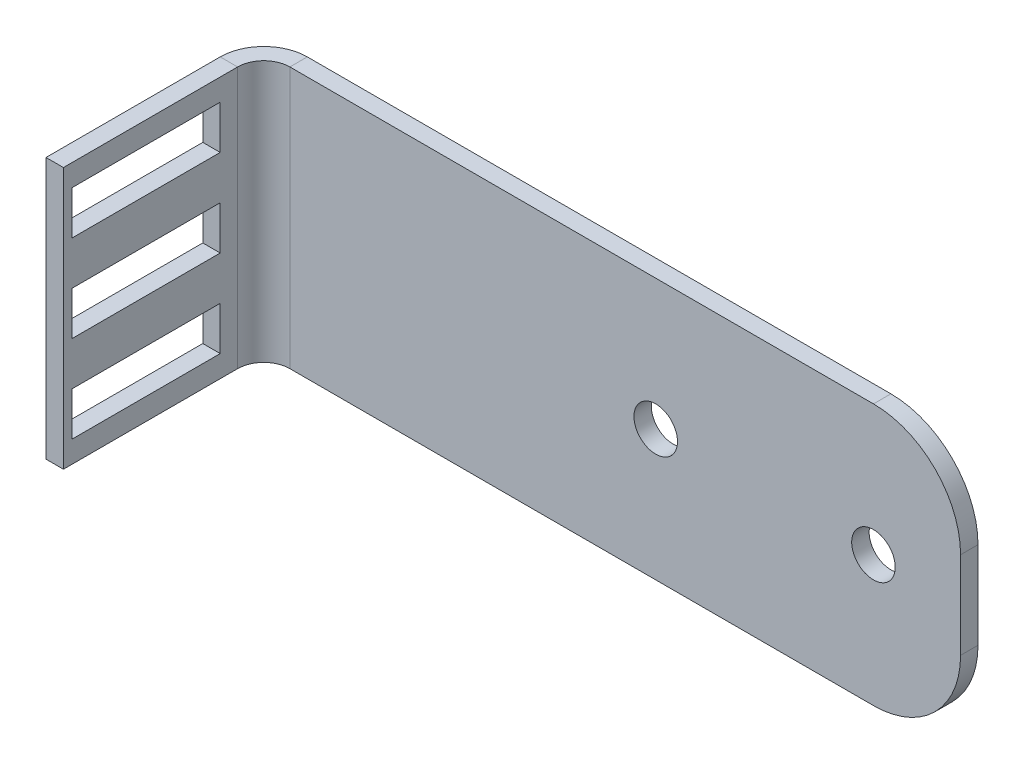
ISO-10303-21;
HEADER;
FILE_DESCRIPTION(('STEP AP214'),'2;1');
FILE_NAME('part.step','',(''),(''),'','','');
FILE_SCHEMA(('AUTOMOTIVE_DESIGN { 1 0 10303 214 1 1 1 1 }'));
ENDSEC;
DATA;
#1=APPLICATION_CONTEXT('core data for automotive mechanical design processes');
#2=APPLICATION_PROTOCOL_DEFINITION('international standard','automotive_design',2000,#1);
#3=PRODUCT_CONTEXT('',#1,'mechanical');
#4=PRODUCT('Part','Part','',(#3));
#5=PRODUCT_RELATED_PRODUCT_CATEGORY('part','',(#4));
#6=PRODUCT_DEFINITION_FORMATION('','',#4);
#7=PRODUCT_DEFINITION_CONTEXT('part definition',#1,'design');
#8=PRODUCT_DEFINITION('design','',#6,#7);
#9=PRODUCT_DEFINITION_SHAPE('','',#8);
#10=(LENGTH_UNIT() NAMED_UNIT(*) SI_UNIT(.MILLI.,.METRE.));
#11=(NAMED_UNIT(*) PLANE_ANGLE_UNIT() SI_UNIT($,.RADIAN.));
#12=(NAMED_UNIT(*) SI_UNIT($,.STERADIAN.) SOLID_ANGLE_UNIT());
#13=UNCERTAINTY_MEASURE_WITH_UNIT(LENGTH_MEASURE(1.E-05),#10,'distance_accuracy_value','');
#14=(GEOMETRIC_REPRESENTATION_CONTEXT(3) GLOBAL_UNCERTAINTY_ASSIGNED_CONTEXT((#13)) GLOBAL_UNIT_ASSIGNED_CONTEXT((#10,
#11,#12)) REPRESENTATION_CONTEXT('',''));
#15=CARTESIAN_POINT('',(0.,0.,0.));
#16=DIRECTION('',(0.,0.,1.));
#17=DIRECTION('',(1.,0.,0.));
#18=AXIS2_PLACEMENT_3D('',#15,#16,#17);
#19=CARTESIAN_POINT('',(-40.,-15.,-2.));
#20=DIRECTION('',(0.,-1.,0.));
#21=DIRECTION('',(0.,0.,-1.));
#22=AXIS2_PLACEMENT_3D('',#19,#20,#21);
#23=PLANE('',#22);
#24=DIRECTION('',(1.,0.,0.));
#25=VECTOR('',#24,1.);
#26=CARTESIAN_POINT('',(-40.,-15.,0.));
#27=LINE('',#26,#25);
#28=CARTESIAN_POINT('',(-37.,-15.,0.));
#29=VERTEX_POINT('',#28);
#30=CARTESIAN_POINT('',(30.,-15.,0.));
#31=VERTEX_POINT('',#30);
#32=EDGE_CURVE('E326',#29,#31,#27,.T.);
#33=ORIENTED_EDGE('',*,*,#32,.F.);
#34=DIRECTION('',(0.,0.,-1.));
#35=VECTOR('',#34,1.);
#36=CARTESIAN_POINT('',(-37.,-15.,0.));
#37=LINE('',#36,#35);
#38=CARTESIAN_POINT('',(-37.,-15.,-2.00000000000002));
#39=VERTEX_POINT('',#38);
#40=EDGE_CURVE('E293',#29,#39,#37,.T.);
#41=ORIENTED_EDGE('',*,*,#40,.T.);
#42=DIRECTION('',(1.,0.,0.));
#43=VECTOR('',#42,1.);
#44=CARTESIAN_POINT('',(-40.,-15.,-2.));
#45=LINE('',#44,#43);
#46=CARTESIAN_POINT('',(30.,-15.,-2.));
#47=VERTEX_POINT('',#46);
#48=EDGE_CURVE('E329',#39,#47,#45,.T.);
#49=ORIENTED_EDGE('',*,*,#48,.T.);
#50=DIRECTION('',(0.,0.,1.));
#51=VECTOR('',#50,1.);
#52=CARTESIAN_POINT('',(30.,-15.,-2.));
#53=LINE('',#52,#51);
#54=EDGE_CURVE('E331',#47,#31,#53,.T.);
#55=ORIENTED_EDGE('',*,*,#54,.T.);
#56=EDGE_LOOP('',(#33,#41,#49,#55));
#57=FACE_BOUND('',#56,.T.);
#58=ADVANCED_FACE('F37',(#57),#23,.T.);
#59=CARTESIAN_POINT('',(0.,0.,-2.));
#60=DIRECTION('',(0.,0.,1.));
#61=DIRECTION('',(1.,0.,0.));
#62=AXIS2_PLACEMENT_3D('',#59,#60,#61);
#63=PLANE('',#62);
#64=CARTESIAN_POINT('',(5.00000000000002,0.,-2.));
#65=DIRECTION('',(0.,0.,1.));
#66=DIRECTION('',(1.,0.,0.));
#67=AXIS2_PLACEMENT_3D('',#64,#65,#66);
#68=CIRCLE('',#67,2.5);
#69=CARTESIAN_POINT('',(7.50000000000002,0.,-2.));
#70=VERTEX_POINT('',#69);
#71=EDGE_CURVE('E316',#70,#70,#68,.T.);
#72=ORIENTED_EDGE('',*,*,#71,.T.);
#73=EDGE_LOOP('',(#72));
#74=FACE_BOUND('',#73,.T.);
#75=CARTESIAN_POINT('',(30.,0.,-2.));
#76=DIRECTION('',(0.,0.,1.));
#77=DIRECTION('',(1.,0.,0.));
#78=AXIS2_PLACEMENT_3D('',#75,#76,#77);
#79=CIRCLE('',#78,2.49999999999999);
#80=CARTESIAN_POINT('',(32.5,0.,-2.));
#81=VERTEX_POINT('',#80);
#82=EDGE_CURVE('E310',#81,#81,#79,.T.);
#83=ORIENTED_EDGE('',*,*,#82,.T.);
#84=EDGE_LOOP('',(#83));
#85=FACE_BOUND('',#84,.T.);
#86=DIRECTION('',(0.,-1.,0.));
#87=VECTOR('',#86,1.);
#88=CARTESIAN_POINT('',(-37.,-15.,-2.00000000000002));
#89=LINE('',#88,#87);
#90=CARTESIAN_POINT('',(-37.,15.,-2.));
#91=VERTEX_POINT('',#90);
#92=EDGE_CURVE('E287',#39,#91,#89,.F.);
#93=ORIENTED_EDGE('',*,*,#92,.T.);
#94=DIRECTION('',(-1.,0.,0.));
#95=VECTOR('',#94,1.);
#96=CARTESIAN_POINT('',(-40.,15.,-2.));
#97=LINE('',#96,#95);
#98=CARTESIAN_POINT('',(30.,15.,-2.));
#99=VERTEX_POINT('',#98);
#100=EDGE_CURVE('E325',#99,#91,#97,.T.);
#101=ORIENTED_EDGE('',*,*,#100,.F.);
#102=CARTESIAN_POINT('',(30.,5.,-2.));
#103=DIRECTION('',(0.,0.,1.));
#104=DIRECTION('',(1.,0.,0.));
#105=AXIS2_PLACEMENT_3D('',#102,#103,#104);
#106=CIRCLE('',#105,10.);
#107=CARTESIAN_POINT('',(40.,5.,-2.));
#108=VERTEX_POINT('',#107);
#109=EDGE_CURVE('E349',#99,#108,#106,.F.);
#110=ORIENTED_EDGE('',*,*,#109,.T.);
#111=DIRECTION('',(0.,1.,0.));
#112=VECTOR('',#111,1.);
#113=CARTESIAN_POINT('',(40.,15.,-2.));
#114=LINE('',#113,#112);
#115=CARTESIAN_POINT('',(40.,-5.,-2.));
#116=VERTEX_POINT('',#115);
#117=EDGE_CURVE('E322',#116,#108,#114,.T.);
#118=ORIENTED_EDGE('',*,*,#117,.F.);
#119=CARTESIAN_POINT('',(30.,-4.99999999999999,-2.));
#120=DIRECTION('',(0.,0.,1.));
#121=DIRECTION('',(1.,0.,0.));
#122=AXIS2_PLACEMENT_3D('',#119,#120,#121);
#123=CIRCLE('',#122,10.);
#124=EDGE_CURVE('E351',#116,#47,#123,.F.);
#125=ORIENTED_EDGE('',*,*,#124,.T.);
#126=ORIENTED_EDGE('',*,*,#48,.F.);
#127=EDGE_LOOP('',(#93,#101,#110,#118,#125,#126));
#128=FACE_BOUND('',#127,.T.);
#129=ADVANCED_FACE('F399',(#74,#85,#128),#63,.F.);
#130=CARTESIAN_POINT('',(0.,0.,0.));
#131=DIRECTION('',(0.,0.,1.));
#132=DIRECTION('',(1.,0.,0.));
#133=AXIS2_PLACEMENT_3D('',#130,#131,#132);
#134=PLANE('',#133);
#135=CARTESIAN_POINT('',(30.,0.,0.));
#136=DIRECTION('',(0.,0.,1.));
#137=DIRECTION('',(1.,0.,0.));
#138=AXIS2_PLACEMENT_3D('',#135,#136,#137);
#139=CIRCLE('',#138,2.49999999999999);
#140=CARTESIAN_POINT('',(32.5,0.,0.));
#141=VERTEX_POINT('',#140);
#142=EDGE_CURVE('E307',#141,#141,#139,.T.);
#143=ORIENTED_EDGE('',*,*,#142,.F.);
#144=EDGE_LOOP('',(#143));
#145=FACE_BOUND('',#144,.T.);
#146=CARTESIAN_POINT('',(5.00000000000002,0.,0.));
#147=DIRECTION('',(0.,0.,1.));
#148=DIRECTION('',(1.,0.,0.));
#149=AXIS2_PLACEMENT_3D('',#146,#147,#148);
#150=CIRCLE('',#149,2.5);
#151=CARTESIAN_POINT('',(7.50000000000002,0.,0.));
#152=VERTEX_POINT('',#151);
#153=EDGE_CURVE('E313',#152,#152,#150,.T.);
#154=ORIENTED_EDGE('',*,*,#153,.F.);
#155=EDGE_LOOP('',(#154));
#156=FACE_BOUND('',#155,.T.);
#157=DIRECTION('',(-1.,0.,0.));
#158=VECTOR('',#157,1.);
#159=CARTESIAN_POINT('',(-40.,15.,0.));
#160=LINE('',#159,#158);
#161=CARTESIAN_POINT('',(30.,15.,0.));
#162=VERTEX_POINT('',#161);
#163=CARTESIAN_POINT('',(-37.,15.,0.));
#164=VERTEX_POINT('',#163);
#165=EDGE_CURVE('E334',#162,#164,#160,.T.);
#166=ORIENTED_EDGE('',*,*,#165,.T.);
#167=DIRECTION('',(0.,-1.,0.));
#168=VECTOR('',#167,1.);
#169=CARTESIAN_POINT('',(-37.,-15.,0.));
#170=LINE('',#169,#168);
#171=EDGE_CURVE('E299',#29,#164,#170,.F.);
#172=ORIENTED_EDGE('',*,*,#171,.F.);
#173=ORIENTED_EDGE('',*,*,#32,.T.);
#174=CARTESIAN_POINT('',(30.,-4.99999999999999,0.));
#175=DIRECTION('',(0.,0.,1.));
#176=DIRECTION('',(1.,0.,0.));
#177=AXIS2_PLACEMENT_3D('',#174,#175,#176);
#178=CIRCLE('',#177,10.);
#179=CARTESIAN_POINT('',(40.,-5.,0.));
#180=VERTEX_POINT('',#179);
#181=EDGE_CURVE('E342',#31,#180,#178,.T.);
#182=ORIENTED_EDGE('',*,*,#181,.T.);
#183=DIRECTION('',(0.,1.,0.));
#184=VECTOR('',#183,1.);
#185=CARTESIAN_POINT('',(40.,15.,0.));
#186=LINE('',#185,#184);
#187=CARTESIAN_POINT('',(40.,5.,0.));
#188=VERTEX_POINT('',#187);
#189=EDGE_CURVE('E319',#180,#188,#186,.T.);
#190=ORIENTED_EDGE('',*,*,#189,.T.);
#191=CARTESIAN_POINT('',(30.,5.,0.));
#192=DIRECTION('',(0.,0.,1.));
#193=DIRECTION('',(1.,0.,0.));
#194=AXIS2_PLACEMENT_3D('',#191,#192,#193);
#195=CIRCLE('',#194,10.);
#196=EDGE_CURVE('E340',#188,#162,#195,.T.);
#197=ORIENTED_EDGE('',*,*,#196,.T.);
#198=EDGE_LOOP('',(#166,#172,#173,#182,#190,#197));
#199=FACE_BOUND('',#198,.T.);
#200=ADVANCED_FACE('F405',(#145,#156,#199),#134,.T.);
#201=CARTESIAN_POINT('',(40.,15.,-2.));
#202=DIRECTION('',(1.,0.,0.));
#203=DIRECTION('',(0.,1.,0.));
#204=AXIS2_PLACEMENT_3D('',#201,#202,#203);
#205=PLANE('',#204);
#206=ORIENTED_EDGE('',*,*,#189,.F.);
#207=DIRECTION('',(0.,0.,1.));
#208=VECTOR('',#207,1.);
#209=CARTESIAN_POINT('',(40.,-5.,-2.));
#210=LINE('',#209,#208);
#211=EDGE_CURVE('E347',#180,#116,#210,.F.);
#212=ORIENTED_EDGE('',*,*,#211,.T.);
#213=ORIENTED_EDGE('',*,*,#117,.T.);
#214=DIRECTION('',(0.,0.,1.));
#215=VECTOR('',#214,1.);
#216=CARTESIAN_POINT('',(40.,5.,-2.));
#217=LINE('',#216,#215);
#218=EDGE_CURVE('E344',#108,#188,#217,.T.);
#219=ORIENTED_EDGE('',*,*,#218,.T.);
#220=EDGE_LOOP('',(#206,#212,#213,#219));
#221=FACE_BOUND('',#220,.T.);
#222=ADVANCED_FACE('F415',(#221),#205,.T.);
#223=CARTESIAN_POINT('',(-40.,15.,-2.));
#224=DIRECTION('',(0.,1.,0.));
#225=DIRECTION('',(0.,0.,1.));
#226=AXIS2_PLACEMENT_3D('',#223,#224,#225);
#227=PLANE('',#226);
#228=DIRECTION('',(0.,0.,-1.));
#229=VECTOR('',#228,1.);
#230=CARTESIAN_POINT('',(-37.,15.,0.));
#231=LINE('',#230,#229);
#232=EDGE_CURVE('E304',#164,#91,#231,.T.);
#233=ORIENTED_EDGE('',*,*,#232,.F.);
#234=ORIENTED_EDGE('',*,*,#165,.F.);
#235=DIRECTION('',(0.,0.,1.));
#236=VECTOR('',#235,1.);
#237=CARTESIAN_POINT('',(30.,15.,-2.));
#238=LINE('',#237,#236);
#239=EDGE_CURVE('E354',#162,#99,#238,.F.);
#240=ORIENTED_EDGE('',*,*,#239,.T.);
#241=ORIENTED_EDGE('',*,*,#100,.T.);
#242=EDGE_LOOP('',(#233,#234,#240,#241));
#243=FACE_BOUND('',#242,.T.);
#244=ADVANCED_FACE('F411',(#243),#227,.T.);
#245=CARTESIAN_POINT('',(5.00000000000002,0.,-2.));
#246=DIRECTION('',(0.,0.,1.));
#247=DIRECTION('',(1.,0.,0.));
#248=AXIS2_PLACEMENT_3D('',#245,#246,#247);
#249=CYLINDRICAL_SURFACE('',#248,2.5);
#250=ORIENTED_EDGE('',*,*,#71,.F.);
#251=EDGE_LOOP('',(#250));
#252=FACE_BOUND('',#251,.T.);
#253=ORIENTED_EDGE('',*,*,#153,.T.);
#254=EDGE_LOOP('',(#253));
#255=FACE_BOUND('',#254,.T.);
#256=ADVANCED_FACE('F414',(#252,#255),#249,.F.);
#257=CARTESIAN_POINT('',(30.,0.,-2.));
#258=DIRECTION('',(0.,0.,1.));
#259=DIRECTION('',(1.,0.,0.));
#260=AXIS2_PLACEMENT_3D('',#257,#258,#259);
#261=CYLINDRICAL_SURFACE('',#260,2.49999999999999);
#262=ORIENTED_EDGE('',*,*,#82,.F.);
#263=EDGE_LOOP('',(#262));
#264=FACE_BOUND('',#263,.T.);
#265=ORIENTED_EDGE('',*,*,#142,.T.);
#266=EDGE_LOOP('',(#265));
#267=FACE_BOUND('',#266,.T.);
#268=ADVANCED_FACE('F421',(#264,#267),#261,.F.);
#269=CARTESIAN_POINT('',(30.,-4.99999999999999,-2.));
#270=DIRECTION('',(0.,0.,1.));
#271=DIRECTION('',(1.,0.,0.));
#272=AXIS2_PLACEMENT_3D('',#269,#270,#271);
#273=CYLINDRICAL_SURFACE('',#272,10.);
#274=ORIENTED_EDGE('',*,*,#124,.F.);
#275=ORIENTED_EDGE('',*,*,#211,.F.);
#276=ORIENTED_EDGE('',*,*,#181,.F.);
#277=ORIENTED_EDGE('',*,*,#54,.F.);
#278=EDGE_LOOP('',(#274,#275,#276,#277));
#279=FACE_BOUND('',#278,.T.);
#280=ADVANCED_FACE('F419',(#279),#273,.T.);
#281=CARTESIAN_POINT('',(30.,5.,-2.));
#282=DIRECTION('',(0.,0.,1.));
#283=DIRECTION('',(1.,0.,0.));
#284=AXIS2_PLACEMENT_3D('',#281,#282,#283);
#285=CYLINDRICAL_SURFACE('',#284,10.);
#286=ORIENTED_EDGE('',*,*,#109,.F.);
#287=ORIENTED_EDGE('',*,*,#239,.F.);
#288=ORIENTED_EDGE('',*,*,#196,.F.);
#289=ORIENTED_EDGE('',*,*,#218,.F.);
#290=EDGE_LOOP('',(#286,#287,#288,#289));
#291=FACE_BOUND('',#290,.T.);
#292=ADVANCED_FACE('F39',(#291),#285,.T.);
#293=CARTESIAN_POINT('',(-37.,15.,3.));
#294=DIRECTION('',(0.,1.,0.));
#295=DIRECTION('',(0.,0.,1.));
#296=AXIS2_PLACEMENT_3D('',#293,#294,#295);
#297=PLANE('',#296);
#298=DIRECTION('',(-1.,0.,0.));
#299=VECTOR('',#298,1.);
#300=CARTESIAN_POINT('',(-40.,15.,2.99999999999999));
#301=LINE('',#300,#299);
#302=CARTESIAN_POINT('',(-40.,15.,2.99999999999999));
#303=VERTEX_POINT('',#302);
#304=CARTESIAN_POINT('',(-42.,15.,2.99999999999998));
#305=VERTEX_POINT('',#304);
#306=EDGE_CURVE('E216',#303,#305,#301,.T.);
#307=ORIENTED_EDGE('',*,*,#306,.F.);
#308=CARTESIAN_POINT('',(-37.,15.,3.));
#309=DIRECTION('',(0.,-1.,0.));
#310=DIRECTION('',(0.,0.,-1.));
#311=AXIS2_PLACEMENT_3D('',#308,#309,#310);
#312=CIRCLE('',#311,3.);
#313=EDGE_CURVE('E296',#164,#303,#312,.F.);
#314=ORIENTED_EDGE('',*,*,#313,.F.);
#315=ORIENTED_EDGE('',*,*,#232,.T.);
#316=CARTESIAN_POINT('',(-37.,15.,3.));
#317=DIRECTION('',(0.,-1.,0.));
#318=DIRECTION('',(0.,0.,-1.));
#319=AXIS2_PLACEMENT_3D('',#316,#317,#318);
#320=CIRCLE('',#319,5.);
#321=EDGE_CURVE('E289',#91,#305,#320,.F.);
#322=ORIENTED_EDGE('',*,*,#321,.T.);
#323=EDGE_LOOP('',(#307,#314,#315,#322));
#324=FACE_BOUND('',#323,.T.);
#325=ADVANCED_FACE('F427',(#324),#297,.T.);
#326=CARTESIAN_POINT('',(-37.,-15.,2.99999999999998));
#327=DIRECTION('',(0.,1.,0.));
#328=DIRECTION('',(0.,0.,1.));
#329=AXIS2_PLACEMENT_3D('',#326,#327,#328);
#330=PLANE('',#329);
#331=CARTESIAN_POINT('',(-37.,-15.,2.99999999999998));
#332=DIRECTION('',(0.,-1.,0.));
#333=DIRECTION('',(0.,0.,-1.));
#334=AXIS2_PLACEMENT_3D('',#331,#332,#333);
#335=CIRCLE('',#334,3.);
#336=CARTESIAN_POINT('',(-40.,-15.,2.99999999999997));
#337=VERTEX_POINT('',#336);
#338=EDGE_CURVE('E286',#337,#29,#335,.T.);
#339=ORIENTED_EDGE('',*,*,#338,.F.);
#340=DIRECTION('',(-1.,0.,0.));
#341=VECTOR('',#340,1.);
#342=CARTESIAN_POINT('',(-40.,-15.,2.99999999999998));
#343=LINE('',#342,#341);
#344=CARTESIAN_POINT('',(-42.,-15.,2.99999999999997));
#345=VERTEX_POINT('',#344);
#346=EDGE_CURVE('E259',#337,#345,#343,.T.);
#347=ORIENTED_EDGE('',*,*,#346,.T.);
#348=CARTESIAN_POINT('',(-37.,-15.,2.99999999999998));
#349=DIRECTION('',(0.,-1.,0.));
#350=DIRECTION('',(0.,0.,-1.));
#351=AXIS2_PLACEMENT_3D('',#348,#349,#350);
#352=CIRCLE('',#351,5.);
#353=EDGE_CURVE('E290',#345,#39,#352,.T.);
#354=ORIENTED_EDGE('',*,*,#353,.T.);
#355=ORIENTED_EDGE('',*,*,#40,.F.);
#356=EDGE_LOOP('',(#339,#347,#354,#355));
#357=FACE_BOUND('',#356,.T.);
#358=ADVANCED_FACE('F489',(#357),#330,.F.);
#359=CARTESIAN_POINT('',(-37.,-15.,2.99999999999998));
#360=DIRECTION('',(0.,-1.,0.));
#361=DIRECTION('',(-1.,0.,0.));
#362=AXIS2_PLACEMENT_3D('',#359,#360,#361);
#363=CYLINDRICAL_SURFACE('',#362,5.);
#364=ORIENTED_EDGE('',*,*,#92,.F.);
#365=ORIENTED_EDGE('',*,*,#353,.F.);
#366=DIRECTION('',(0.,1.,0.));
#367=VECTOR('',#366,1.);
#368=CARTESIAN_POINT('',(-42.,0.,2.99999999999998));
#369=LINE('',#368,#367);
#370=EDGE_CURVE('E262',#345,#305,#369,.T.);
#371=ORIENTED_EDGE('',*,*,#370,.T.);
#372=ORIENTED_EDGE('',*,*,#321,.F.);
#373=EDGE_LOOP('',(#364,#365,#371,#372));
#374=FACE_BOUND('',#373,.T.);
#375=ADVANCED_FACE('F449',(#374),#363,.T.);
#376=CARTESIAN_POINT('',(-37.,-15.,2.99999999999998));
#377=DIRECTION('',(0.,-1.,0.));
#378=DIRECTION('',(-1.,0.,0.));
#379=AXIS2_PLACEMENT_3D('',#376,#377,#378);
#380=CYLINDRICAL_SURFACE('',#379,3.);
#381=ORIENTED_EDGE('',*,*,#171,.T.);
#382=ORIENTED_EDGE('',*,*,#313,.T.);
#383=DIRECTION('',(0.,-1.,0.));
#384=VECTOR('',#383,1.);
#385=CARTESIAN_POINT('',(-40.,15.,2.99999999999999));
#386=LINE('',#385,#384);
#387=EDGE_CURVE('E257',#303,#337,#386,.T.);
#388=ORIENTED_EDGE('',*,*,#387,.T.);
#389=ORIENTED_EDGE('',*,*,#338,.T.);
#390=EDGE_LOOP('',(#381,#382,#388,#389));
#391=FACE_BOUND('',#390,.T.);
#392=ADVANCED_FACE('F469',(#391),#380,.F.);
#393=CARTESIAN_POINT('',(-42.,15.,0.));
#394=DIRECTION('',(0.,-1.,0.));
#395=DIRECTION('',(1.,0.,0.));
#396=AXIS2_PLACEMENT_3D('',#393,#394,#395);
#397=PLANE('',#396);
#398=ORIENTED_EDGE('',*,*,#306,.T.);
#399=DIRECTION('',(0.,0.,-1.));
#400=VECTOR('',#399,1.);
#401=CARTESIAN_POINT('',(-42.,15.,0.));
#402=LINE('',#401,#400);
#403=CARTESIAN_POINT('',(-42.0000000000001,15.,23.));
#404=VERTEX_POINT('',#403);
#405=EDGE_CURVE('E267',#404,#305,#402,.T.);
#406=ORIENTED_EDGE('',*,*,#405,.F.);
#407=DIRECTION('',(1.,0.,0.));
#408=VECTOR('',#407,1.);
#409=CARTESIAN_POINT('',(-42.0000000000001,15.,23.));
#410=LINE('',#409,#408);
#411=CARTESIAN_POINT('',(-40.0000000000001,15.,23.));
#412=VERTEX_POINT('',#411);
#413=EDGE_CURVE('E275',#404,#412,#410,.T.);
#414=ORIENTED_EDGE('',*,*,#413,.T.);
#415=DIRECTION('',(0.,0.,-1.));
#416=VECTOR('',#415,1.);
#417=CARTESIAN_POINT('',(-40.,15.,0.));
#418=LINE('',#417,#416);
#419=EDGE_CURVE('E266',#412,#303,#418,.T.);
#420=ORIENTED_EDGE('',*,*,#419,.T.);
#421=EDGE_LOOP('',(#398,#406,#414,#420));
#422=FACE_BOUND('',#421,.T.);
#423=ADVANCED_FACE('F466',(#422),#397,.F.);
#424=CARTESIAN_POINT('',(-42.0000000000001,-15.,23.));
#425=DIRECTION('',(0.,1.,0.));
#426=DIRECTION('',(-1.,0.,0.));
#427=AXIS2_PLACEMENT_3D('',#424,#425,#426);
#428=PLANE('',#427);
#429=ORIENTED_EDGE('',*,*,#346,.F.);
#430=DIRECTION('',(0.,0.,1.));
#431=VECTOR('',#430,1.);
#432=CARTESIAN_POINT('',(-40.0000000000001,-15.,23.));
#433=LINE('',#432,#431);
#434=CARTESIAN_POINT('',(-40.0000000000001,-15.,23.));
#435=VERTEX_POINT('',#434);
#436=EDGE_CURVE('E278',#337,#435,#433,.T.);
#437=ORIENTED_EDGE('',*,*,#436,.T.);
#438=DIRECTION('',(1.,0.,0.));
#439=VECTOR('',#438,1.);
#440=CARTESIAN_POINT('',(-42.0000000000001,-15.,23.));
#441=LINE('',#440,#439);
#442=CARTESIAN_POINT('',(-42.0000000000001,-15.,23.));
#443=VERTEX_POINT('',#442);
#444=EDGE_CURVE('E283',#443,#435,#441,.T.);
#445=ORIENTED_EDGE('',*,*,#444,.F.);
#446=DIRECTION('',(0.,0.,1.));
#447=VECTOR('',#446,1.);
#448=CARTESIAN_POINT('',(-42.0000000000001,-15.,23.));
#449=LINE('',#448,#447);
#450=EDGE_CURVE('E270',#345,#443,#449,.T.);
#451=ORIENTED_EDGE('',*,*,#450,.F.);
#452=EDGE_LOOP('',(#429,#437,#445,#451));
#453=FACE_BOUND('',#452,.T.);
#454=ADVANCED_FACE('F457',(#453),#428,.F.);
#455=CARTESIAN_POINT('',(-42.,0.,-1.39727019969824E-13));
#456=DIRECTION('',(1.,0.,0.));
#457=DIRECTION('',(0.,0.,-1.));
#458=AXIS2_PLACEMENT_3D('',#455,#456,#457);
#459=PLANE('',#458);
#460=DIRECTION('',(0.,0.,-1.));
#461=VECTOR('',#460,1.);
#462=CARTESIAN_POINT('',(-42.,12.5,4.99999999999997));
#463=LINE('',#462,#461);
#464=CARTESIAN_POINT('',(-42.0000000000001,12.5,22.));
#465=VERTEX_POINT('',#464);
#466=CARTESIAN_POINT('',(-42.,12.5,4.99999999999997));
#467=VERTEX_POINT('',#466);
#468=EDGE_CURVE('E202',#465,#467,#463,.T.);
#469=ORIENTED_EDGE('',*,*,#468,.F.);
#470=DIRECTION('',(0.,1.,0.));
#471=VECTOR('',#470,1.);
#472=CARTESIAN_POINT('',(-42.0000000000001,7.50000000000001,22.));
#473=LINE('',#472,#471);
#474=CARTESIAN_POINT('',(-42.0000000000001,7.50000000000001,22.));
#475=VERTEX_POINT('',#474);
#476=EDGE_CURVE('E52',#475,#465,#473,.T.);
#477=ORIENTED_EDGE('',*,*,#476,.F.);
#478=DIRECTION('',(0.,0.,1.));
#479=VECTOR('',#478,1.);
#480=CARTESIAN_POINT('',(-42.,7.50000000000001,4.99999999999997));
#481=LINE('',#480,#479);
#482=CARTESIAN_POINT('',(-42.,7.50000000000001,4.99999999999997));
#483=VERTEX_POINT('',#482);
#484=EDGE_CURVE('E209',#483,#475,#481,.T.);
#485=ORIENTED_EDGE('',*,*,#484,.F.);
#486=DIRECTION('',(0.,-1.,0.));
#487=VECTOR('',#486,1.);
#488=CARTESIAN_POINT('',(-42.,7.50000000000001,4.99999999999997));
#489=LINE('',#488,#487);
#490=EDGE_CURVE('E192',#467,#483,#489,.T.);
#491=ORIENTED_EDGE('',*,*,#490,.F.);
#492=EDGE_LOOP('',(#469,#477,#485,#491));
#493=FACE_BOUND('',#492,.T.);
#494=DIRECTION('',(0.,-1.,0.));
#495=VECTOR('',#494,1.);
#496=CARTESIAN_POINT('',(-42.,-2.49999999999999,4.99999999999997));
#497=LINE('',#496,#495);
#498=CARTESIAN_POINT('',(-42.,2.50000000000001,4.99999999999997));
#499=VERTEX_POINT('',#498);
#500=CARTESIAN_POINT('',(-42.,-2.49999999999999,4.99999999999997));
#501=VERTEX_POINT('',#500);
#502=EDGE_CURVE('E220',#499,#501,#497,.T.);
#503=ORIENTED_EDGE('',*,*,#502,.F.);
#504=DIRECTION('',(0.,0.,-1.));
#505=VECTOR('',#504,1.);
#506=CARTESIAN_POINT('',(-42.,2.50000000000001,4.99999999999997));
#507=LINE('',#506,#505);
#508=CARTESIAN_POINT('',(-42.0000000000001,2.50000000000001,22.));
#509=VERTEX_POINT('',#508);
#510=EDGE_CURVE('E60',#509,#499,#507,.T.);
#511=ORIENTED_EDGE('',*,*,#510,.F.);
#512=DIRECTION('',(0.,1.,0.));
#513=VECTOR('',#512,1.);
#514=CARTESIAN_POINT('',(-42.0000000000001,-2.49999999999999,22.));
#515=LINE('',#514,#513);
#516=CARTESIAN_POINT('',(-42.0000000000001,-2.49999999999999,22.));
#517=VERTEX_POINT('',#516);
#518=EDGE_CURVE('E227',#517,#509,#515,.T.);
#519=ORIENTED_EDGE('',*,*,#518,.F.);
#520=DIRECTION('',(0.,0.,1.));
#521=VECTOR('',#520,1.);
#522=CARTESIAN_POINT('',(-42.,-2.49999999999999,4.99999999999997));
#523=LINE('',#522,#521);
#524=EDGE_CURVE('E224',#501,#517,#523,.T.);
#525=ORIENTED_EDGE('',*,*,#524,.F.);
#526=EDGE_LOOP('',(#503,#511,#519,#525));
#527=FACE_BOUND('',#526,.T.);
#528=DIRECTION('',(0.,-1.,0.));
#529=VECTOR('',#528,1.);
#530=CARTESIAN_POINT('',(-42.,-12.5,4.99999999999997));
#531=LINE('',#530,#529);
#532=CARTESIAN_POINT('',(-42.,-7.49999999999999,4.99999999999997));
#533=VERTEX_POINT('',#532);
#534=CARTESIAN_POINT('',(-42.,-12.5,4.99999999999997));
#535=VERTEX_POINT('',#534);
#536=EDGE_CURVE('E240',#533,#535,#531,.T.);
#537=ORIENTED_EDGE('',*,*,#536,.F.);
#538=DIRECTION('',(0.,0.,-1.));
#539=VECTOR('',#538,1.);
#540=CARTESIAN_POINT('',(-42.,-7.49999999999999,4.99999999999997));
#541=LINE('',#540,#539);
#542=CARTESIAN_POINT('',(-42.0000000000001,-7.49999999999999,22.));
#543=VERTEX_POINT('',#542);
#544=EDGE_CURVE('E238',#543,#533,#541,.T.);
#545=ORIENTED_EDGE('',*,*,#544,.F.);
#546=DIRECTION('',(0.,1.,0.));
#547=VECTOR('',#546,1.);
#548=CARTESIAN_POINT('',(-42.0000000000001,-12.5,22.));
#549=LINE('',#548,#547);
#550=CARTESIAN_POINT('',(-42.0000000000001,-12.5,22.));
#551=VERTEX_POINT('',#550);
#552=EDGE_CURVE('E246',#551,#543,#549,.T.);
#553=ORIENTED_EDGE('',*,*,#552,.F.);
#554=DIRECTION('',(0.,0.,1.));
#555=VECTOR('',#554,1.);
#556=CARTESIAN_POINT('',(-42.,-12.5,4.99999999999997));
#557=LINE('',#556,#555);
#558=EDGE_CURVE('E243',#535,#551,#557,.T.);
#559=ORIENTED_EDGE('',*,*,#558,.F.);
#560=EDGE_LOOP('',(#537,#545,#553,#559));
#561=FACE_BOUND('',#560,.T.);
#562=ORIENTED_EDGE('',*,*,#370,.F.);
#563=ORIENTED_EDGE('',*,*,#450,.T.);
#564=DIRECTION('',(0.,1.,0.));
#565=VECTOR('',#564,1.);
#566=CARTESIAN_POINT('',(-42.0000000000001,15.,23.));
#567=LINE('',#566,#565);
#568=EDGE_CURVE('E273',#443,#404,#567,.T.);
#569=ORIENTED_EDGE('',*,*,#568,.T.);
#570=ORIENTED_EDGE('',*,*,#405,.T.);
#571=EDGE_LOOP('',(#562,#563,#569,#570));
#572=FACE_BOUND('',#571,.T.);
#573=ADVANCED_FACE('F206',(#493,#527,#561,#572),#459,.F.);
#574=CARTESIAN_POINT('',(-40.,0.,-1.32744057292138E-13));
#575=DIRECTION('',(1.,0.,0.));
#576=DIRECTION('',(0.,0.,-1.));
#577=AXIS2_PLACEMENT_3D('',#574,#575,#576);
#578=PLANE('',#577);
#579=DIRECTION('',(0.,-1.,0.));
#580=VECTOR('',#579,1.);
#581=CARTESIAN_POINT('',(-40.0000000000001,0.,22.));
#582=LINE('',#581,#580);
#583=CARTESIAN_POINT('',(-40.,12.5,22.));
#584=VERTEX_POINT('',#583);
#585=CARTESIAN_POINT('',(-40.,7.50000000000001,22.));
#586=VERTEX_POINT('',#585);
#587=EDGE_CURVE('E11',#584,#586,#582,.T.);
#588=ORIENTED_EDGE('',*,*,#587,.F.);
#589=DIRECTION('',(0.,0.,1.));
#590=VECTOR('',#589,1.);
#591=CARTESIAN_POINT('',(-40.,12.5,-1.32744057292138E-13));
#592=LINE('',#591,#590);
#593=CARTESIAN_POINT('',(-40.,12.5,4.99999999999997));
#594=VERTEX_POINT('',#593);
#595=EDGE_CURVE('E374',#594,#584,#592,.T.);
#596=ORIENTED_EDGE('',*,*,#595,.F.);
#597=DIRECTION('',(0.,1.,0.));
#598=VECTOR('',#597,1.);
#599=CARTESIAN_POINT('',(-40.,0.,4.99999999999998));
#600=LINE('',#599,#598);
#601=CARTESIAN_POINT('',(-40.,7.50000000000001,4.99999999999998));
#602=VERTEX_POINT('',#601);
#603=EDGE_CURVE('E195',#602,#594,#600,.T.);
#604=ORIENTED_EDGE('',*,*,#603,.F.);
#605=DIRECTION('',(0.,0.,-1.));
#606=VECTOR('',#605,1.);
#607=CARTESIAN_POINT('',(-40.,7.50000000000001,-1.32744057292138E-13));
#608=LINE('',#607,#606);
#609=EDGE_CURVE('E45',#586,#602,#608,.T.);
#610=ORIENTED_EDGE('',*,*,#609,.F.);
#611=EDGE_LOOP('',(#588,#596,#604,#610));
#612=FACE_BOUND('',#611,.T.);
#613=DIRECTION('',(0.,0.,1.));
#614=VECTOR('',#613,1.);
#615=CARTESIAN_POINT('',(-40.,2.50000000000001,-1.32744057292138E-13));
#616=LINE('',#615,#614);
#617=CARTESIAN_POINT('',(-40.,2.50000000000001,4.99999999999998));
#618=VERTEX_POINT('',#617);
#619=CARTESIAN_POINT('',(-40.0000000000001,2.50000000000001,22.));
#620=VERTEX_POINT('',#619);
#621=EDGE_CURVE('E372',#618,#620,#616,.T.);
#622=ORIENTED_EDGE('',*,*,#621,.F.);
#623=DIRECTION('',(0.,1.,0.));
#624=VECTOR('',#623,1.);
#625=CARTESIAN_POINT('',(-40.,0.,4.99999999999998));
#626=LINE('',#625,#624);
#627=CARTESIAN_POINT('',(-40.,-2.49999999999999,4.99999999999998));
#628=VERTEX_POINT('',#627);
#629=EDGE_CURVE('E365',#628,#618,#626,.T.);
#630=ORIENTED_EDGE('',*,*,#629,.F.);
#631=DIRECTION('',(0.,0.,-1.));
#632=VECTOR('',#631,1.);
#633=CARTESIAN_POINT('',(-40.,-2.49999999999999,-1.32744057292138E-13));
#634=LINE('',#633,#632);
#635=CARTESIAN_POINT('',(-40.,-2.49999999999999,22.));
#636=VERTEX_POINT('',#635);
#637=EDGE_CURVE('E367',#636,#628,#634,.T.);
#638=ORIENTED_EDGE('',*,*,#637,.F.);
#639=DIRECTION('',(0.,-1.,0.));
#640=VECTOR('',#639,1.);
#641=CARTESIAN_POINT('',(-40.0000000000001,0.,22.));
#642=LINE('',#641,#640);
#643=EDGE_CURVE('E370',#620,#636,#642,.T.);
#644=ORIENTED_EDGE('',*,*,#643,.F.);
#645=EDGE_LOOP('',(#622,#630,#638,#644));
#646=FACE_BOUND('',#645,.T.);
#647=DIRECTION('',(0.,0.,1.));
#648=VECTOR('',#647,1.);
#649=CARTESIAN_POINT('',(-40.,-7.49999999999999,-1.32744057292138E-13));
#650=LINE('',#649,#648);
#651=CARTESIAN_POINT('',(-40.,-7.49999999999999,4.99999999999998));
#652=VERTEX_POINT('',#651);
#653=CARTESIAN_POINT('',(-40.0000000000001,-7.49999999999999,22.));
#654=VERTEX_POINT('',#653);
#655=EDGE_CURVE('E363',#652,#654,#650,.T.);
#656=ORIENTED_EDGE('',*,*,#655,.F.);
#657=DIRECTION('',(0.,1.,0.));
#658=VECTOR('',#657,1.);
#659=CARTESIAN_POINT('',(-40.,0.,4.99999999999998));
#660=LINE('',#659,#658);
#661=CARTESIAN_POINT('',(-40.,-12.5,4.99999999999998));
#662=VERTEX_POINT('',#661);
#663=EDGE_CURVE('E356',#662,#652,#660,.T.);
#664=ORIENTED_EDGE('',*,*,#663,.F.);
#665=DIRECTION('',(0.,0.,-1.));
#666=VECTOR('',#665,1.);
#667=CARTESIAN_POINT('',(-40.,-12.5,-1.32744057292138E-13));
#668=LINE('',#667,#666);
#669=CARTESIAN_POINT('',(-40.,-12.5,22.));
#670=VERTEX_POINT('',#669);
#671=EDGE_CURVE('E358',#670,#662,#668,.T.);
#672=ORIENTED_EDGE('',*,*,#671,.F.);
#673=DIRECTION('',(0.,-1.,0.));
#674=VECTOR('',#673,1.);
#675=CARTESIAN_POINT('',(-40.0000000000001,0.,22.));
#676=LINE('',#675,#674);
#677=EDGE_CURVE('E361',#654,#670,#676,.T.);
#678=ORIENTED_EDGE('',*,*,#677,.F.);
#679=EDGE_LOOP('',(#656,#664,#672,#678));
#680=FACE_BOUND('',#679,.T.);
#681=ORIENTED_EDGE('',*,*,#436,.F.);
#682=ORIENTED_EDGE('',*,*,#387,.F.);
#683=ORIENTED_EDGE('',*,*,#419,.F.);
#684=DIRECTION('',(0.,1.,0.));
#685=VECTOR('',#684,1.);
#686=CARTESIAN_POINT('',(-40.0000000000001,15.,23.));
#687=LINE('',#686,#685);
#688=EDGE_CURVE('E271',#435,#412,#687,.T.);
#689=ORIENTED_EDGE('',*,*,#688,.F.);
#690=EDGE_LOOP('',(#681,#682,#683,#689));
#691=FACE_BOUND('',#690,.T.);
#692=ADVANCED_FACE('F382',(#612,#646,#680,#691),#578,.T.);
#693=CARTESIAN_POINT('',(-42.0000000000001,15.,23.));
#694=DIRECTION('',(0.,0.,-1.));
#695=DIRECTION('',(-1.,0.,0.));
#696=AXIS2_PLACEMENT_3D('',#693,#694,#695);
#697=PLANE('',#696);
#698=ORIENTED_EDGE('',*,*,#688,.T.);
#699=ORIENTED_EDGE('',*,*,#413,.F.);
#700=ORIENTED_EDGE('',*,*,#568,.F.);
#701=ORIENTED_EDGE('',*,*,#444,.T.);
#702=EDGE_LOOP('',(#698,#699,#700,#701));
#703=FACE_BOUND('',#702,.T.);
#704=ADVANCED_FACE('F463',(#703),#697,.F.);
#705=CARTESIAN_POINT('',(-32.,-7.49999999999999,5.));
#706=DIRECTION('',(0.,1.,0.));
#707=DIRECTION('',(-1.,0.,0.));
#708=AXIS2_PLACEMENT_3D('',#705,#706,#707);
#709=PLANE('',#708);
#710=ORIENTED_EDGE('',*,*,#655,.T.);
#711=DIRECTION('',(-1.,0.,0.));
#712=VECTOR('',#711,1.);
#713=CARTESIAN_POINT('',(-32.0000000000001,-7.49999999999999,22.));
#714=LINE('',#713,#712);
#715=EDGE_CURVE('E221',#654,#543,#714,.T.);
#716=ORIENTED_EDGE('',*,*,#715,.T.);
#717=ORIENTED_EDGE('',*,*,#544,.T.);
#718=DIRECTION('',(-1.,0.,0.));
#719=VECTOR('',#718,1.);
#720=CARTESIAN_POINT('',(-32.,-7.49999999999999,5.));
#721=LINE('',#720,#719);
#722=EDGE_CURVE('E249',#652,#533,#721,.T.);
#723=ORIENTED_EDGE('',*,*,#722,.F.);
#724=EDGE_LOOP('',(#710,#716,#717,#723));
#725=FACE_BOUND('',#724,.T.);
#726=ADVANCED_FACE('F478',(#725),#709,.F.);
#727=CARTESIAN_POINT('',(-32.0000000000001,-12.5,22.));
#728=DIRECTION('',(0.,0.,1.));
#729=DIRECTION('',(1.,0.,0.));
#730=AXIS2_PLACEMENT_3D('',#727,#728,#729);
#731=PLANE('',#730);
#732=ORIENTED_EDGE('',*,*,#677,.T.);
#733=DIRECTION('',(-1.,0.,0.));
#734=VECTOR('',#733,1.);
#735=CARTESIAN_POINT('',(-32.0000000000001,-12.5,22.));
#736=LINE('',#735,#734);
#737=EDGE_CURVE('E251',#670,#551,#736,.T.);
#738=ORIENTED_EDGE('',*,*,#737,.T.);
#739=ORIENTED_EDGE('',*,*,#552,.T.);
#740=ORIENTED_EDGE('',*,*,#715,.F.);
#741=EDGE_LOOP('',(#732,#738,#739,#740));
#742=FACE_BOUND('',#741,.T.);
#743=ADVANCED_FACE('F595',(#742),#731,.F.);
#744=CARTESIAN_POINT('',(-32.,-12.5,5.));
#745=DIRECTION('',(0.,-1.,0.));
#746=DIRECTION('',(1.,0.,0.));
#747=AXIS2_PLACEMENT_3D('',#744,#745,#746);
#748=PLANE('',#747);
#749=ORIENTED_EDGE('',*,*,#671,.T.);
#750=DIRECTION('',(-1.,0.,0.));
#751=VECTOR('',#750,1.);
#752=CARTESIAN_POINT('',(-32.,-12.5,5.));
#753=LINE('',#752,#751);
#754=EDGE_CURVE('E253',#662,#535,#753,.T.);
#755=ORIENTED_EDGE('',*,*,#754,.T.);
#756=ORIENTED_EDGE('',*,*,#558,.T.);
#757=ORIENTED_EDGE('',*,*,#737,.F.);
#758=EDGE_LOOP('',(#749,#755,#756,#757));
#759=FACE_BOUND('',#758,.T.);
#760=ADVANCED_FACE('F605',(#759),#748,.F.);
#761=CARTESIAN_POINT('',(-32.,-12.5,5.));
#762=DIRECTION('',(0.,0.,-1.));
#763=DIRECTION('',(-1.,0.,0.));
#764=AXIS2_PLACEMENT_3D('',#761,#762,#763);
#765=PLANE('',#764);
#766=ORIENTED_EDGE('',*,*,#663,.T.);
#767=ORIENTED_EDGE('',*,*,#722,.T.);
#768=ORIENTED_EDGE('',*,*,#536,.T.);
#769=ORIENTED_EDGE('',*,*,#754,.F.);
#770=EDGE_LOOP('',(#766,#767,#768,#769));
#771=FACE_BOUND('',#770,.T.);
#772=ADVANCED_FACE('F616',(#771),#765,.F.);
#773=CARTESIAN_POINT('',(-32.,2.50000000000001,5.00000000000001));
#774=DIRECTION('',(0.,1.,0.));
#775=DIRECTION('',(-1.,0.,0.));
#776=AXIS2_PLACEMENT_3D('',#773,#774,#775);
#777=PLANE('',#776);
#778=ORIENTED_EDGE('',*,*,#621,.T.);
#779=DIRECTION('',(-1.,0.,0.));
#780=VECTOR('',#779,1.);
#781=CARTESIAN_POINT('',(-32.0000000000001,2.50000000000001,22.));
#782=LINE('',#781,#780);
#783=EDGE_CURVE('E231',#620,#509,#782,.T.);
#784=ORIENTED_EDGE('',*,*,#783,.T.);
#785=ORIENTED_EDGE('',*,*,#510,.T.);
#786=DIRECTION('',(-1.,0.,0.));
#787=VECTOR('',#786,1.);
#788=CARTESIAN_POINT('',(-32.,2.50000000000001,5.00000000000001));
#789=LINE('',#788,#787);
#790=EDGE_CURVE('E230',#618,#499,#789,.T.);
#791=ORIENTED_EDGE('',*,*,#790,.F.);
#792=EDGE_LOOP('',(#778,#784,#785,#791));
#793=FACE_BOUND('',#792,.T.);
#794=ADVANCED_FACE('F627',(#793),#777,.F.);
#795=CARTESIAN_POINT('',(-32.0000000000001,-2.49999999999999,22.));
#796=DIRECTION('',(0.,0.,1.));
#797=DIRECTION('',(1.,0.,0.));
#798=AXIS2_PLACEMENT_3D('',#795,#796,#797);
#799=PLANE('',#798);
#800=ORIENTED_EDGE('',*,*,#643,.T.);
#801=DIRECTION('',(-1.,0.,0.));
#802=VECTOR('',#801,1.);
#803=CARTESIAN_POINT('',(-32.0000000000001,-2.49999999999999,22.));
#804=LINE('',#803,#802);
#805=EDGE_CURVE('E233',#636,#517,#804,.T.);
#806=ORIENTED_EDGE('',*,*,#805,.T.);
#807=ORIENTED_EDGE('',*,*,#518,.T.);
#808=ORIENTED_EDGE('',*,*,#783,.F.);
#809=EDGE_LOOP('',(#800,#806,#807,#808));
#810=FACE_BOUND('',#809,.T.);
#811=ADVANCED_FACE('F638',(#810),#799,.F.);
#812=CARTESIAN_POINT('',(-32.,-2.49999999999999,5.00000000000001));
#813=DIRECTION('',(0.,-1.,0.));
#814=DIRECTION('',(1.,0.,0.));
#815=AXIS2_PLACEMENT_3D('',#812,#813,#814);
#816=PLANE('',#815);
#817=ORIENTED_EDGE('',*,*,#637,.T.);
#818=DIRECTION('',(-1.,0.,0.));
#819=VECTOR('',#818,1.);
#820=CARTESIAN_POINT('',(-32.,-2.49999999999999,5.00000000000001));
#821=LINE('',#820,#819);
#822=EDGE_CURVE('E235',#628,#501,#821,.T.);
#823=ORIENTED_EDGE('',*,*,#822,.T.);
#824=ORIENTED_EDGE('',*,*,#524,.T.);
#825=ORIENTED_EDGE('',*,*,#805,.F.);
#826=EDGE_LOOP('',(#817,#823,#824,#825));
#827=FACE_BOUND('',#826,.T.);
#828=ADVANCED_FACE('F393',(#827),#816,.F.);
#829=CARTESIAN_POINT('',(-32.,-2.49999999999999,5.00000000000001));
#830=DIRECTION('',(0.,0.,-1.));
#831=DIRECTION('',(-1.,0.,0.));
#832=AXIS2_PLACEMENT_3D('',#829,#830,#831);
#833=PLANE('',#832);
#834=ORIENTED_EDGE('',*,*,#629,.T.);
#835=ORIENTED_EDGE('',*,*,#790,.T.);
#836=ORIENTED_EDGE('',*,*,#502,.T.);
#837=ORIENTED_EDGE('',*,*,#822,.F.);
#838=EDGE_LOOP('',(#834,#835,#836,#837));
#839=FACE_BOUND('',#838,.T.);
#840=ADVANCED_FACE('F386',(#839),#833,.F.);
#841=CARTESIAN_POINT('',(-32.0000000000001,7.50000000000001,22.));
#842=DIRECTION('',(0.,0.,1.));
#843=DIRECTION('',(1.,0.,0.));
#844=AXIS2_PLACEMENT_3D('',#841,#842,#843);
#845=PLANE('',#844);
#846=ORIENTED_EDGE('',*,*,#587,.T.);
#847=DIRECTION('',(-1.,0.,0.));
#848=VECTOR('',#847,1.);
#849=CARTESIAN_POINT('',(-32.0000000000001,7.50000000000001,22.));
#850=LINE('',#849,#848);
#851=EDGE_CURVE('E214',#586,#475,#850,.T.);
#852=ORIENTED_EDGE('',*,*,#851,.T.);
#853=ORIENTED_EDGE('',*,*,#476,.T.);
#854=DIRECTION('',(-1.,0.,0.));
#855=VECTOR('',#854,1.);
#856=CARTESIAN_POINT('',(-32.0000000000001,12.5,22.));
#857=LINE('',#856,#855);
#858=EDGE_CURVE('E199',#584,#465,#857,.T.);
#859=ORIENTED_EDGE('',*,*,#858,.F.);
#860=EDGE_LOOP('',(#846,#852,#853,#859));
#861=FACE_BOUND('',#860,.T.);
#862=ADVANCED_FACE('F384',(#861),#845,.F.);
#863=CARTESIAN_POINT('',(-32.,7.50000000000001,5.00000000000001));
#864=DIRECTION('',(0.,-1.,0.));
#865=DIRECTION('',(1.,0.,0.));
#866=AXIS2_PLACEMENT_3D('',#863,#864,#865);
#867=PLANE('',#866);
#868=ORIENTED_EDGE('',*,*,#609,.T.);
#869=DIRECTION('',(-1.,0.,0.));
#870=VECTOR('',#869,1.);
#871=CARTESIAN_POINT('',(-32.,7.50000000000001,5.00000000000001));
#872=LINE('',#871,#870);
#873=EDGE_CURVE('E198',#602,#483,#872,.T.);
#874=ORIENTED_EDGE('',*,*,#873,.T.);
#875=ORIENTED_EDGE('',*,*,#484,.T.);
#876=ORIENTED_EDGE('',*,*,#851,.F.);
#877=EDGE_LOOP('',(#868,#874,#875,#876));
#878=FACE_BOUND('',#877,.T.);
#879=ADVANCED_FACE('F379',(#878),#867,.F.);
#880=CARTESIAN_POINT('',(-32.,7.50000000000001,5.00000000000001));
#881=DIRECTION('',(0.,0.,-1.));
#882=DIRECTION('',(-1.,0.,0.));
#883=AXIS2_PLACEMENT_3D('',#880,#881,#882);
#884=PLANE('',#883);
#885=ORIENTED_EDGE('',*,*,#603,.T.);
#886=DIRECTION('',(-1.,0.,0.));
#887=VECTOR('',#886,1.);
#888=CARTESIAN_POINT('',(-32.,12.5,5.00000000000001));
#889=LINE('',#888,#887);
#890=EDGE_CURVE('E187',#594,#467,#889,.T.);
#891=ORIENTED_EDGE('',*,*,#890,.T.);
#892=ORIENTED_EDGE('',*,*,#490,.T.);
#893=ORIENTED_EDGE('',*,*,#873,.F.);
#894=EDGE_LOOP('',(#885,#891,#892,#893));
#895=FACE_BOUND('',#894,.T.);
#896=ADVANCED_FACE('F189',(#895),#884,.F.);
#897=CARTESIAN_POINT('',(-32.,12.5,5.00000000000001));
#898=DIRECTION('',(0.,1.,0.));
#899=DIRECTION('',(-1.,0.,0.));
#900=AXIS2_PLACEMENT_3D('',#897,#898,#899);
#901=PLANE('',#900);
#902=ORIENTED_EDGE('',*,*,#595,.T.);
#903=ORIENTED_EDGE('',*,*,#858,.T.);
#904=ORIENTED_EDGE('',*,*,#468,.T.);
#905=ORIENTED_EDGE('',*,*,#890,.F.);
#906=EDGE_LOOP('',(#902,#903,#904,#905));
#907=FACE_BOUND('',#906,.T.);
#908=ADVANCED_FACE('F203',(#907),#901,.F.);
#909=CLOSED_SHELL('',(#58,#129,#200,#222,#244,#256,#268,#280,#292,#325,#358,#375,#392,#423,#454,
#573,#692,#704,#726,#743,#760,#772,#794,#811,#828,#840,#862,#879,#896,#908));
#910=MANIFOLD_SOLID_BREP('B2',#909);
#911=ADVANCED_BREP_SHAPE_REPRESENTATION('',(#18,#910),#14);
#912=SHAPE_DEFINITION_REPRESENTATION(#9,#911);
ENDSEC;
END-ISO-10303-21;
